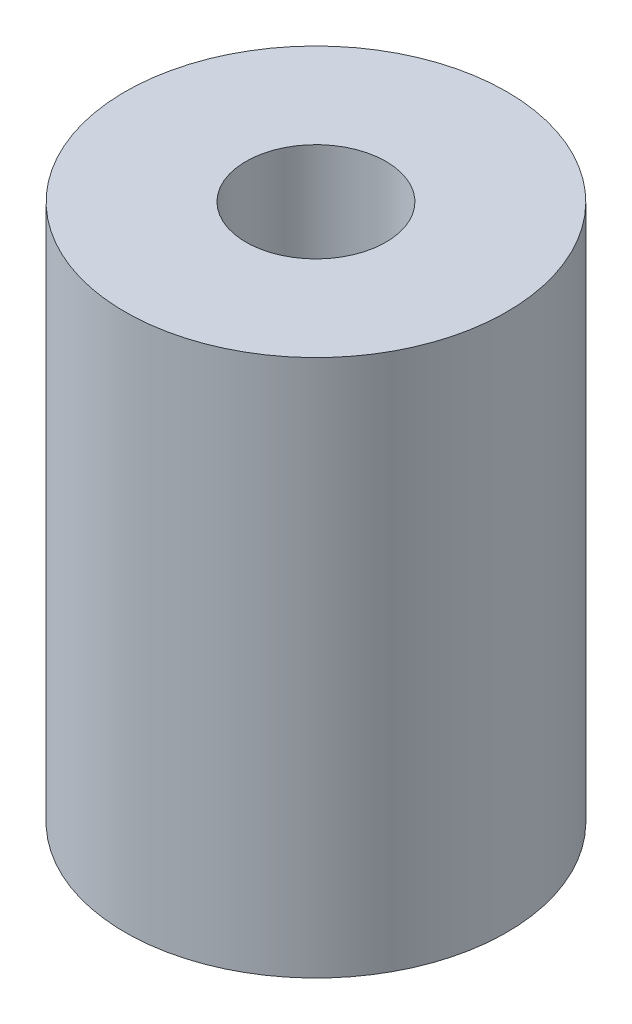
ISO-10303-21;
HEADER;
FILE_DESCRIPTION(('STEP AP214'),'2;1');
FILE_NAME('part.step','',(''),(''),'','','');
FILE_SCHEMA(('AUTOMOTIVE_DESIGN { 1 0 10303 214 1 1 1 1 }'));
ENDSEC;
DATA;
#1=APPLICATION_CONTEXT('core data for automotive mechanical design processes');
#2=APPLICATION_PROTOCOL_DEFINITION('international standard','automotive_design',2000,#1);
#3=PRODUCT_CONTEXT('',#1,'mechanical');
#4=PRODUCT('Part','Part','',(#3));
#5=PRODUCT_RELATED_PRODUCT_CATEGORY('part','',(#4));
#6=PRODUCT_DEFINITION_FORMATION('','',#4);
#7=PRODUCT_DEFINITION_CONTEXT('part definition',#1,'design');
#8=PRODUCT_DEFINITION('design','',#6,#7);
#9=PRODUCT_DEFINITION_SHAPE('','',#8);
#10=(LENGTH_UNIT() NAMED_UNIT(*) SI_UNIT(.MILLI.,.METRE.));
#11=(NAMED_UNIT(*) PLANE_ANGLE_UNIT() SI_UNIT($,.RADIAN.));
#12=(NAMED_UNIT(*) SI_UNIT($,.STERADIAN.) SOLID_ANGLE_UNIT());
#13=UNCERTAINTY_MEASURE_WITH_UNIT(LENGTH_MEASURE(1.E-05),#10,'distance_accuracy_value','');
#14=(GEOMETRIC_REPRESENTATION_CONTEXT(3) GLOBAL_UNCERTAINTY_ASSIGNED_CONTEXT((#13)) GLOBAL_UNIT_ASSIGNED_CONTEXT((#10,
#11,#12)) REPRESENTATION_CONTEXT('',''));
#15=CARTESIAN_POINT('',(0.,0.,0.));
#16=DIRECTION('',(0.,0.,1.));
#17=DIRECTION('',(1.,0.,0.));
#18=AXIS2_PLACEMENT_3D('',#15,#16,#17);
#19=CARTESIAN_POINT('',(0.,42.2400874835666,0.));
#20=DIRECTION('',(0.,-1.,0.));
#21=DIRECTION('',(0.,0.,-1.));
#22=AXIS2_PLACEMENT_3D('',#19,#20,#21);
#23=CYLINDRICAL_SURFACE('',#22,15.);
#24=CARTESIAN_POINT('',(0.,42.2400874835666,0.));
#25=DIRECTION('',(0.,1.,0.));
#26=DIRECTION('',(0.,0.,1.));
#27=AXIS2_PLACEMENT_3D('',#24,#25,#26);
#28=CIRCLE('',#27,15.);
#29=CARTESIAN_POINT('',(0.,42.2400874835666,-15.));
#30=VERTEX_POINT('',#29);
#31=EDGE_CURVE('E10',#30,#30,#28,.T.);
#32=CARTESIAN_POINT('',(0.,0.,0.));
#33=DIRECTION('',(0.,1.,0.));
#34=DIRECTION('',(0.,0.,1.));
#35=AXIS2_PLACEMENT_3D('',#32,#33,#34);
#36=CIRCLE('',#35,15.);
#37=CARTESIAN_POINT('',(0.,0.,-15.));
#38=VERTEX_POINT('',#37);
#39=EDGE_CURVE('E37',#38,#38,#36,.T.);
#40=CARTESIAN_POINT('',(0.,42.2400874835666,-15.));
#41=CARTESIAN_POINT('',(0.,41.8000865722795,-15.));
#42=CARTESIAN_POINT('',(0.,41.3600856609923,-15.));
#43=CARTESIAN_POINT('',(0.,40.480083838418,-15.));
#44=CARTESIAN_POINT('',(0.,40.0400829271309,-15.));
#45=CARTESIAN_POINT('',(0.,39.1600811045566,-15.));
#46=CARTESIAN_POINT('',(0.,38.7200801932694,-15.));
#47=CARTESIAN_POINT('',(0.,37.8400783706951,-15.));
#48=CARTESIAN_POINT('',(0.,37.400077459408,-15.));
#49=CARTESIAN_POINT('',(0.,36.5200756368337,-15.));
#50=CARTESIAN_POINT('',(0.,36.0800747255465,-15.));
#51=CARTESIAN_POINT('',(0.,35.2000729029722,-15.));
#52=CARTESIAN_POINT('',(0.,34.760071991685,-15.));
#53=CARTESIAN_POINT('',(0.,33.8800701691107,-15.));
#54=CARTESIAN_POINT('',(0.,33.4400692578236,-15.));
#55=CARTESIAN_POINT('',(0.,32.5600674352493,-15.));
#56=CARTESIAN_POINT('',(0.,32.1200665239621,-15.));
#57=CARTESIAN_POINT('',(0.,31.2400647013878,-15.));
#58=CARTESIAN_POINT('',(0.,30.8000637901007,-15.));
#59=CARTESIAN_POINT('',(0.,29.9200619675264,-15.));
#60=CARTESIAN_POINT('',(0.,29.4800610562392,-15.));
#61=CARTESIAN_POINT('',(0.,28.6000592336649,-15.));
#62=CARTESIAN_POINT('',(0.,28.1600583223778,-15.));
#63=CARTESIAN_POINT('',(0.,27.2800564998035,-15.));
#64=CARTESIAN_POINT('',(0.,26.8400555885163,-15.));
#65=CARTESIAN_POINT('',(0.,25.960053765942,-15.));
#66=CARTESIAN_POINT('',(0.,25.5200528546548,-15.));
#67=CARTESIAN_POINT('',(0.,24.6400510320805,-15.));
#68=CARTESIAN_POINT('',(0.,24.2000501207934,-15.));
#69=CARTESIAN_POINT('',(0.,23.3200482982191,-15.));
#70=CARTESIAN_POINT('',(0.,22.8800473869319,-15.));
#71=CARTESIAN_POINT('',(0.,22.0000455643576,-15.));
#72=CARTESIAN_POINT('',(0.,21.5600446530705,-15.));
#73=CARTESIAN_POINT('',(0.,20.6800428304962,-15.));
#74=CARTESIAN_POINT('',(0.,20.240041919209,-15.));
#75=CARTESIAN_POINT('',(0.,19.3600400966347,-15.));
#76=CARTESIAN_POINT('',(0.,18.9200391853476,-15.));
#77=CARTESIAN_POINT('',(0.,18.0400373627732,-15.));
#78=CARTESIAN_POINT('',(0.,17.6000364514861,-15.));
#79=CARTESIAN_POINT('',(0.,16.7200346289118,-15.));
#80=CARTESIAN_POINT('',(0.,16.2800337176246,-15.));
#81=CARTESIAN_POINT('',(0.,15.4000318950503,-15.));
#82=CARTESIAN_POINT('',(0.,14.9600309837632,-15.));
#83=CARTESIAN_POINT('',(0.,14.0800291611889,-15.));
#84=CARTESIAN_POINT('',(0.,13.6400282499017,-15.));
#85=CARTESIAN_POINT('',(0.,12.7600264273274,-15.));
#86=CARTESIAN_POINT('',(0.,12.3200255160403,-15.));
#87=CARTESIAN_POINT('',(0.,11.440023693466,-15.));
#88=CARTESIAN_POINT('',(0.,11.0000227821788,-15.));
#89=CARTESIAN_POINT('',(0.,10.1200209596045,-15.));
#90=CARTESIAN_POINT('',(0.,9.68002004831735,-15.));
#91=CARTESIAN_POINT('',(0.,8.80001822574304,-15.));
#92=CARTESIAN_POINT('',(0.,8.36001731445589,-15.));
#93=CARTESIAN_POINT('',(0.,7.48001549188159,-15.));
#94=CARTESIAN_POINT('',(0.,7.04001458059443,-15.));
#95=CARTESIAN_POINT('',(0.,6.16001275802013,-15.));
#96=CARTESIAN_POINT('',(0.,5.72001184673298,-15.));
#97=CARTESIAN_POINT('',(0.,4.84001002415867,-15.));
#98=CARTESIAN_POINT('',(0.,4.40000911287152,-15.));
#99=CARTESIAN_POINT('',(0.,3.52000729029722,-15.));
#100=CARTESIAN_POINT('',(0.,3.08000637901006,-15.));
#101=CARTESIAN_POINT('',(0.,2.20000455643576,-15.));
#102=CARTESIAN_POINT('',(0.,1.7600036451486,-15.));
#103=CARTESIAN_POINT('',(0.,0.880001822574299,-15.));
#104=CARTESIAN_POINT('',(0.,0.440000911287146,-15.));
#105=CARTESIAN_POINT('',(0.,0.,-15.));
#106=B_SPLINE_CURVE_WITH_KNOTS('',3,(#40,#41,#42,#43,#44,#45,#46,#47,#48,#49,#50,#51,#52,#53,
#54,#55,#56,#57,#58,#59,#60,#61,#62,#63,#64,#65,#66,#67,#68,#69,#70,#71,#72,#73,#74,#75,#76,#77,
#78,#79,#80,#81,#82,#83,#84,#85,#86,#87,#88,#89,#90,#91,#92,#93,#94,#95,#96,#97,#98,#99,#100,
#101,#102,#103,#104,#105),.UNSPECIFIED.,.F.,.F.,(4,2,2,2,2,2,2,2,2,2,2,2,2,2,2,2,2,2,2,2,2,2,2,
2,2,2,2,2,2,2,2,2,4),(0.,1.32000273386145,2.64000546772291,3.96000820158437,5.28001093544583,
6.60001366930728,7.92001640316874,9.2400191370302,10.5600218708917,11.8800246047531,
13.2000273386146,14.520030072476,15.8400328063375,17.1600355401989,18.4800382740604,
19.8000410079219,21.1200437417833,22.4400464756448,23.7600492095062,25.0800519433677,
26.4000546772291,27.7200574110906,29.0400601449521,30.3600628788135,31.680065612675,
33.0000683465364,34.3200710803979,35.6400738142593,36.9600765481208,38.2800792819823,
39.6000820158437,40.9200847497052,42.2400874835666),.UNSPECIFIED.);
#107=EDGE_CURVE('BSEAM40',#30,#38,#106,.T.);
#108=ORIENTED_EDGE('',*,*,#31,.F.);
#109=ORIENTED_EDGE('',*,*,#39,.T.);
#110=ORIENTED_EDGE('',*,*,#107,.T.);
#111=ORIENTED_EDGE('',*,*,#107,.F.);
#112=EDGE_LOOP('',(#108,#110,#109,#111));
#113=FACE_BOUND('',#112,.T.);
#114=ADVANCED_FACE('F40',(#113),#23,.T.);
#115=CARTESIAN_POINT('',(0.,42.2400874835666,0.));
#116=DIRECTION('',(0.,1.,0.));
#117=DIRECTION('',(0.,0.,1.));
#118=AXIS2_PLACEMENT_3D('',#115,#116,#117);
#119=PLANE('',#118);
#120=CARTESIAN_POINT('',(0.,42.2400874835666,0.));
#121=DIRECTION('',(0.,1.,0.));
#122=DIRECTION('',(0.,0.,1.));
#123=AXIS2_PLACEMENT_3D('',#120,#121,#122);
#124=CIRCLE('',#123,5.50426745331671);
#125=CARTESIAN_POINT('',(0.,42.2400874835666,-5.50426745331671));
#126=VERTEX_POINT('',#125);
#127=EDGE_CURVE('E50',#126,#126,#124,.T.);
#128=ORIENTED_EDGE('',*,*,#127,.F.);
#129=EDGE_LOOP('',(#128));
#130=FACE_BOUND('',#129,.T.);
#131=ORIENTED_EDGE('',*,*,#31,.T.);
#132=EDGE_LOOP('',(#131));
#133=FACE_BOUND('',#132,.T.);
#134=ADVANCED_FACE('F59',(#130,#133),#119,.T.);
#135=CARTESIAN_POINT('',(0.,0.,0.));
#136=DIRECTION('',(0.,1.,0.));
#137=DIRECTION('',(0.,0.,1.));
#138=AXIS2_PLACEMENT_3D('',#135,#136,#137);
#139=PLANE('',#138);
#140=CARTESIAN_POINT('',(0.,0.,0.));
#141=DIRECTION('',(0.,1.,0.));
#142=DIRECTION('',(0.,0.,1.));
#143=AXIS2_PLACEMENT_3D('',#140,#141,#142);
#144=CIRCLE('',#143,5.50426745331671);
#145=CARTESIAN_POINT('',(0.,0.,-5.50426745331671));
#146=VERTEX_POINT('',#145);
#147=EDGE_CURVE('E47',#146,#146,#144,.T.);
#148=ORIENTED_EDGE('',*,*,#147,.T.);
#149=EDGE_LOOP('',(#148));
#150=FACE_BOUND('',#149,.T.);
#151=ORIENTED_EDGE('',*,*,#39,.F.);
#152=EDGE_LOOP('',(#151));
#153=FACE_BOUND('',#152,.T.);
#154=ADVANCED_FACE('F58',(#150,#153),#139,.F.);
#155=CARTESIAN_POINT('',(0.,42.2400874835666,0.));
#156=DIRECTION('',(0.,-1.,0.));
#157=DIRECTION('',(0.,0.,-1.));
#158=AXIS2_PLACEMENT_3D('',#155,#156,#157);
#159=CYLINDRICAL_SURFACE('',#158,5.50426745331671);
#160=CARTESIAN_POINT('',(0.,42.2400874835666,-5.50426745331671));
#161=CARTESIAN_POINT('',(0.,41.8000865722795,-5.50426745331671));
#162=CARTESIAN_POINT('',(0.,41.3600856609923,-5.50426745331671));
#163=CARTESIAN_POINT('',(0.,40.480083838418,-5.50426745331671));
#164=CARTESIAN_POINT('',(0.,40.0400829271309,-5.50426745331671));
#165=CARTESIAN_POINT('',(0.,39.1600811045566,-5.50426745331671));
#166=CARTESIAN_POINT('',(0.,38.7200801932694,-5.50426745331671));
#167=CARTESIAN_POINT('',(0.,37.8400783706951,-5.50426745331671));
#168=CARTESIAN_POINT('',(0.,37.400077459408,-5.50426745331671));
#169=CARTESIAN_POINT('',(0.,36.5200756368337,-5.50426745331671));
#170=CARTESIAN_POINT('',(0.,36.0800747255465,-5.50426745331671));
#171=CARTESIAN_POINT('',(0.,35.2000729029722,-5.50426745331671));
#172=CARTESIAN_POINT('',(0.,34.760071991685,-5.50426745331671));
#173=CARTESIAN_POINT('',(0.,33.8800701691107,-5.50426745331671));
#174=CARTESIAN_POINT('',(0.,33.4400692578236,-5.50426745331671));
#175=CARTESIAN_POINT('',(0.,32.5600674352493,-5.50426745331671));
#176=CARTESIAN_POINT('',(0.,32.1200665239621,-5.50426745331671));
#177=CARTESIAN_POINT('',(0.,31.2400647013878,-5.50426745331671));
#178=CARTESIAN_POINT('',(0.,30.8000637901007,-5.50426745331671));
#179=CARTESIAN_POINT('',(0.,29.9200619675264,-5.50426745331671));
#180=CARTESIAN_POINT('',(0.,29.4800610562392,-5.50426745331671));
#181=CARTESIAN_POINT('',(0.,28.6000592336649,-5.50426745331671));
#182=CARTESIAN_POINT('',(0.,28.1600583223778,-5.50426745331671));
#183=CARTESIAN_POINT('',(0.,27.2800564998035,-5.50426745331671));
#184=CARTESIAN_POINT('',(0.,26.8400555885163,-5.50426745331671));
#185=CARTESIAN_POINT('',(0.,25.960053765942,-5.50426745331671));
#186=CARTESIAN_POINT('',(0.,25.5200528546548,-5.50426745331671));
#187=CARTESIAN_POINT('',(0.,24.6400510320805,-5.50426745331671));
#188=CARTESIAN_POINT('',(0.,24.2000501207934,-5.50426745331671));
#189=CARTESIAN_POINT('',(0.,23.3200482982191,-5.50426745331671));
#190=CARTESIAN_POINT('',(0.,22.8800473869319,-5.50426745331671));
#191=CARTESIAN_POINT('',(0.,22.0000455643576,-5.50426745331671));
#192=CARTESIAN_POINT('',(0.,21.5600446530705,-5.50426745331671));
#193=CARTESIAN_POINT('',(0.,20.6800428304962,-5.50426745331671));
#194=CARTESIAN_POINT('',(0.,20.240041919209,-5.50426745331671));
#195=CARTESIAN_POINT('',(0.,19.3600400966347,-5.50426745331671));
#196=CARTESIAN_POINT('',(0.,18.9200391853476,-5.50426745331671));
#197=CARTESIAN_POINT('',(0.,18.0400373627732,-5.50426745331671));
#198=CARTESIAN_POINT('',(0.,17.6000364514861,-5.50426745331671));
#199=CARTESIAN_POINT('',(0.,16.7200346289118,-5.50426745331671));
#200=CARTESIAN_POINT('',(0.,16.2800337176246,-5.50426745331671));
#201=CARTESIAN_POINT('',(0.,15.4000318950503,-5.50426745331671));
#202=CARTESIAN_POINT('',(0.,14.9600309837632,-5.50426745331671));
#203=CARTESIAN_POINT('',(0.,14.0800291611889,-5.50426745331671));
#204=CARTESIAN_POINT('',(0.,13.6400282499017,-5.50426745331671));
#205=CARTESIAN_POINT('',(0.,12.7600264273274,-5.50426745331671));
#206=CARTESIAN_POINT('',(0.,12.3200255160403,-5.50426745331671));
#207=CARTESIAN_POINT('',(0.,11.440023693466,-5.50426745331671));
#208=CARTESIAN_POINT('',(0.,11.0000227821788,-5.50426745331671));
#209=CARTESIAN_POINT('',(0.,10.1200209596045,-5.50426745331671));
#210=CARTESIAN_POINT('',(0.,9.68002004831735,-5.50426745331671));
#211=CARTESIAN_POINT('',(0.,8.80001822574304,-5.50426745331671));
#212=CARTESIAN_POINT('',(0.,8.36001731445589,-5.50426745331671));
#213=CARTESIAN_POINT('',(0.,7.48001549188159,-5.50426745331671));
#214=CARTESIAN_POINT('',(0.,7.04001458059443,-5.50426745331671));
#215=CARTESIAN_POINT('',(0.,6.16001275802013,-5.50426745331671));
#216=CARTESIAN_POINT('',(0.,5.72001184673298,-5.50426745331671));
#217=CARTESIAN_POINT('',(0.,4.84001002415867,-5.50426745331671));
#218=CARTESIAN_POINT('',(0.,4.40000911287152,-5.50426745331671));
#219=CARTESIAN_POINT('',(0.,3.52000729029722,-5.50426745331671));
#220=CARTESIAN_POINT('',(0.,3.08000637901006,-5.50426745331671));
#221=CARTESIAN_POINT('',(0.,2.20000455643576,-5.50426745331671));
#222=CARTESIAN_POINT('',(0.,1.7600036451486,-5.50426745331671));
#223=CARTESIAN_POINT('',(0.,0.880001822574299,-5.50426745331671));
#224=CARTESIAN_POINT('',(0.,0.440000911287146,-5.50426745331671));
#225=CARTESIAN_POINT('',(0.,0.,-5.50426745331671));
#226=B_SPLINE_CURVE_WITH_KNOTS('',3,(#160,#161,#162,#163,#164,#165,#166,#167,#168,#169,#170,
#171,#172,#173,#174,#175,#176,#177,#178,#179,#180,#181,#182,#183,#184,#185,#186,#187,#188,#189,
#190,#191,#192,#193,#194,#195,#196,#197,#198,#199,#200,#201,#202,#203,#204,#205,#206,#207,#208,
#209,#210,#211,#212,#213,#214,#215,#216,#217,#218,#219,#220,#221,#222,#223,#224,#225),
.UNSPECIFIED.,.F.,.F.,(4,2,2,2,2,2,2,2,2,2,2,2,2,2,2,2,2,2,2,2,2,2,2,2,2,2,2,2,2,2,2,2,4),(0.,
1.32000273386145,2.64000546772291,3.96000820158437,5.28001093544583,6.60001366930728,
7.92001640316874,9.2400191370302,10.5600218708917,11.8800246047531,13.2000273386146,
14.520030072476,15.8400328063375,17.1600355401989,18.4800382740604,19.8000410079219,
21.1200437417833,22.4400464756448,23.7600492095062,25.0800519433677,26.4000546772291,
27.7200574110906,29.0400601449521,30.3600628788135,31.680065612675,33.0000683465364,
34.3200710803979,35.6400738142593,36.9600765481208,38.2800792819823,39.6000820158437,
40.9200847497052,42.2400874835666),.UNSPECIFIED.);
#227=EDGE_CURVE('BSEAM54',#126,#146,#226,.T.);
#228=ORIENTED_EDGE('',*,*,#127,.T.);
#229=ORIENTED_EDGE('',*,*,#147,.F.);
#230=ORIENTED_EDGE('',*,*,#227,.T.);
#231=ORIENTED_EDGE('',*,*,#227,.F.);
#232=EDGE_LOOP('',(#228,#230,#229,#231));
#233=FACE_BOUND('',#232,.T.);
#234=ADVANCED_FACE('F54',(#233),#159,.F.);
#235=CLOSED_SHELL('',(#114,#134,#154,#234));
#236=MANIFOLD_SOLID_BREP('B2',#235);
#237=ADVANCED_BREP_SHAPE_REPRESENTATION('',(#18,#236),#14);
#238=SHAPE_DEFINITION_REPRESENTATION(#9,#237);
ENDSEC;
END-ISO-10303-21;
